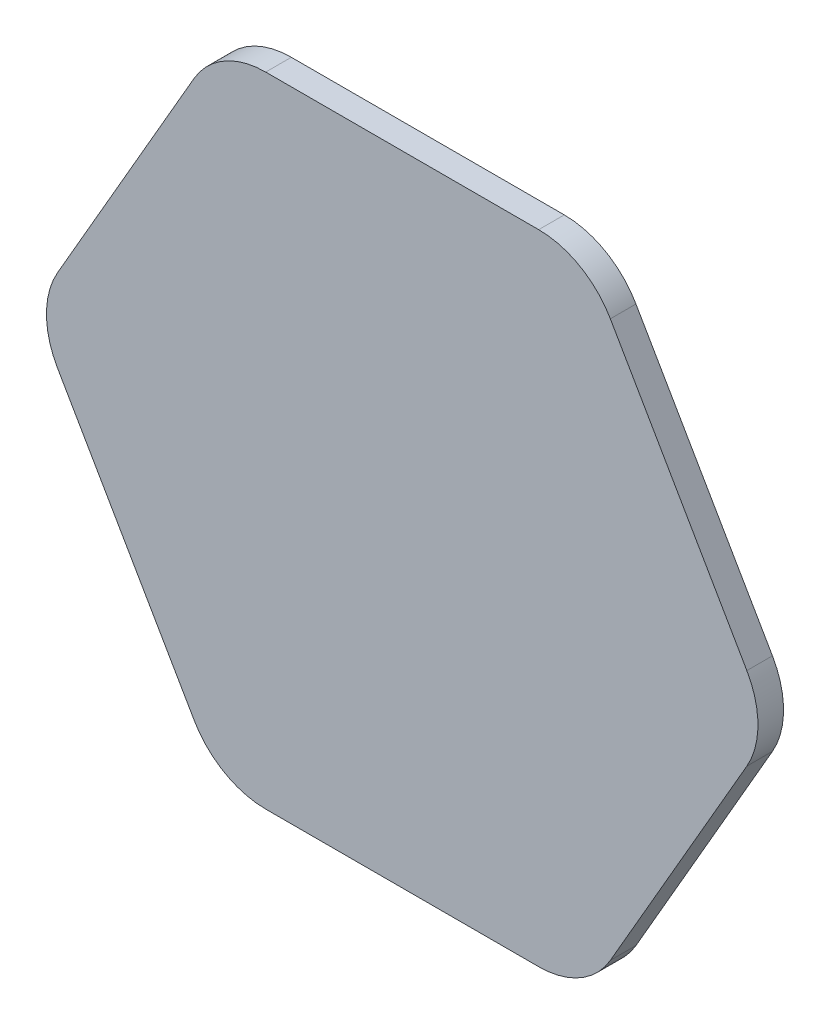
ISO-10303-21;
HEADER;
FILE_DESCRIPTION(('STEP AP214'),'2;1');
FILE_NAME('part.step','',(''),(''),'','','');
FILE_SCHEMA(('AUTOMOTIVE_DESIGN { 1 0 10303 214 1 1 1 1 }'));
ENDSEC;
DATA;
#1=APPLICATION_CONTEXT('core data for automotive mechanical design processes');
#2=APPLICATION_PROTOCOL_DEFINITION('international standard','automotive_design',2000,#1);
#3=PRODUCT_CONTEXT('',#1,'mechanical');
#4=PRODUCT('Part','Part','',(#3));
#5=PRODUCT_RELATED_PRODUCT_CATEGORY('part','',(#4));
#6=PRODUCT_DEFINITION_FORMATION('','',#4);
#7=PRODUCT_DEFINITION_CONTEXT('part definition',#1,'design');
#8=PRODUCT_DEFINITION('design','',#6,#7);
#9=PRODUCT_DEFINITION_SHAPE('','',#8);
#10=(LENGTH_UNIT() NAMED_UNIT(*) SI_UNIT(.MILLI.,.METRE.));
#11=(NAMED_UNIT(*) PLANE_ANGLE_UNIT() SI_UNIT($,.RADIAN.));
#12=(NAMED_UNIT(*) SI_UNIT($,.STERADIAN.) SOLID_ANGLE_UNIT());
#13=UNCERTAINTY_MEASURE_WITH_UNIT(LENGTH_MEASURE(1.E-05),#10,'distance_accuracy_value','');
#14=(GEOMETRIC_REPRESENTATION_CONTEXT(3) GLOBAL_UNCERTAINTY_ASSIGNED_CONTEXT((#13)) GLOBAL_UNIT_ASSIGNED_CONTEXT((#10,
#11,#12)) REPRESENTATION_CONTEXT('',''));
#15=CARTESIAN_POINT('',(0.,0.,0.));
#16=DIRECTION('',(0.,0.,1.));
#17=DIRECTION('',(1.,0.,0.));
#18=AXIS2_PLACEMENT_3D('',#15,#16,#17);
#19=CARTESIAN_POINT('',(25.4,43.9940905122495,4.7625));
#20=DIRECTION('',(0.,0.,-1.));
#21=DIRECTION('',(-1.,0.,0.));
#22=AXIS2_PLACEMENT_3D('',#19,#20,#21);
#23=CYLINDRICAL_SURFACE('',#22,15.3974594877505);
#24=CARTESIAN_POINT('',(25.4,43.9940905122495,0.));
#25=DIRECTION('',(0.,0.,1.));
#26=DIRECTION('',(1.,0.,0.));
#27=AXIS2_PLACEMENT_3D('',#24,#25,#26);
#28=CIRCLE('',#27,15.3974594877505);
#29=CARTESIAN_POINT('',(38.7345910701337,51.6928202561248,0.));
#30=VERTEX_POINT('',#29);
#31=CARTESIAN_POINT('',(25.4,59.39155,0.));
#32=VERTEX_POINT('',#31);
#33=EDGE_CURVE('E155',#30,#32,#28,.T.);
#34=ORIENTED_EDGE('',*,*,#33,.T.);
#35=DIRECTION('',(0.,0.,-1.));
#36=VECTOR('',#35,1.);
#37=CARTESIAN_POINT('',(25.4,59.39155,4.7625));
#38=LINE('',#37,#36);
#39=CARTESIAN_POINT('',(25.4,59.39155,4.7625));
#40=VERTEX_POINT('',#39);
#41=EDGE_CURVE('E11',#40,#32,#38,.T.);
#42=ORIENTED_EDGE('',*,*,#41,.F.);
#43=CARTESIAN_POINT('',(25.4,43.9940905122495,4.7625));
#44=DIRECTION('',(0.,0.,1.));
#45=DIRECTION('',(1.,0.,0.));
#46=AXIS2_PLACEMENT_3D('',#43,#44,#45);
#47=CIRCLE('',#46,15.3974594877505);
#48=CARTESIAN_POINT('',(38.7345910701337,51.6928202561248,4.7625));
#49=VERTEX_POINT('',#48);
#50=EDGE_CURVE('E177',#49,#40,#47,.T.);
#51=ORIENTED_EDGE('',*,*,#50,.F.);
#52=DIRECTION('',(0.,0.,-1.));
#53=VECTOR('',#52,1.);
#54=CARTESIAN_POINT('',(38.7345910701337,51.6928202561248,4.7625));
#55=LINE('',#54,#53);
#56=EDGE_CURVE('E151',#49,#30,#55,.T.);
#57=ORIENTED_EDGE('',*,*,#56,.T.);
#58=EDGE_LOOP('',(#34,#42,#51,#57));
#59=FACE_BOUND('',#58,.T.);
#60=ADVANCED_FACE('F35',(#59),#23,.T.);
#61=CARTESIAN_POINT('',(25.4,59.39155,4.7625));
#62=DIRECTION('',(0.,-1.,0.));
#63=DIRECTION('',(0.,0.,-1.));
#64=AXIS2_PLACEMENT_3D('',#61,#62,#63);
#65=PLANE('',#64);
#66=DIRECTION('',(-1.,0.,0.));
#67=VECTOR('',#66,1.);
#68=CARTESIAN_POINT('',(25.4,59.39155,0.));
#69=LINE('',#68,#67);
#70=CARTESIAN_POINT('',(-25.4,59.39155,0.));
#71=VERTEX_POINT('',#70);
#72=EDGE_CURVE('E158',#32,#71,#69,.T.);
#73=ORIENTED_EDGE('',*,*,#72,.T.);
#74=DIRECTION('',(0.,0.,-1.));
#75=VECTOR('',#74,1.);
#76=CARTESIAN_POINT('',(-25.4,59.39155,4.7625));
#77=LINE('',#76,#75);
#78=CARTESIAN_POINT('',(-25.4,59.39155,4.7625));
#79=VERTEX_POINT('',#78);
#80=EDGE_CURVE('E43',#79,#71,#77,.T.);
#81=ORIENTED_EDGE('',*,*,#80,.F.);
#82=DIRECTION('',(-1.,0.,0.));
#83=VECTOR('',#82,1.);
#84=CARTESIAN_POINT('',(25.4,59.39155,4.7625));
#85=LINE('',#84,#83);
#86=EDGE_CURVE('E106',#40,#79,#85,.T.);
#87=ORIENTED_EDGE('',*,*,#86,.F.);
#88=ORIENTED_EDGE('',*,*,#41,.T.);
#89=EDGE_LOOP('',(#73,#81,#87,#88));
#90=FACE_BOUND('',#89,.T.);
#91=ADVANCED_FACE('F255',(#90),#65,.F.);
#92=CARTESIAN_POINT('',(-25.4,43.9940905122495,4.7625));
#93=DIRECTION('',(0.,0.,-1.));
#94=DIRECTION('',(-1.,0.,0.));
#95=AXIS2_PLACEMENT_3D('',#92,#93,#94);
#96=CYLINDRICAL_SURFACE('',#95,15.3974594877505);
#97=CARTESIAN_POINT('',(-25.4,43.9940905122495,0.));
#98=DIRECTION('',(0.,0.,1.));
#99=DIRECTION('',(1.,0.,0.));
#100=AXIS2_PLACEMENT_3D('',#97,#98,#99);
#101=CIRCLE('',#100,15.3974594877505);
#102=CARTESIAN_POINT('',(-38.7345910701337,51.6928202561247,0.));
#103=VERTEX_POINT('',#102);
#104=EDGE_CURVE('E160',#71,#103,#101,.T.);
#105=ORIENTED_EDGE('',*,*,#104,.T.);
#106=DIRECTION('',(0.,0.,-1.));
#107=VECTOR('',#106,1.);
#108=CARTESIAN_POINT('',(-38.7345910701337,51.6928202561247,4.7625));
#109=LINE('',#108,#107);
#110=CARTESIAN_POINT('',(-38.7345910701337,51.6928202561247,4.7625));
#111=VERTEX_POINT('',#110);
#112=EDGE_CURVE('E196',#111,#103,#109,.T.);
#113=ORIENTED_EDGE('',*,*,#112,.F.);
#114=CARTESIAN_POINT('',(-25.4,43.9940905122495,4.7625));
#115=DIRECTION('',(0.,0.,1.));
#116=DIRECTION('',(1.,0.,0.));
#117=AXIS2_PLACEMENT_3D('',#114,#115,#116);
#118=CIRCLE('',#117,15.3974594877505);
#119=EDGE_CURVE('E204',#79,#111,#118,.T.);
#120=ORIENTED_EDGE('',*,*,#119,.F.);
#121=ORIENTED_EDGE('',*,*,#80,.T.);
#122=EDGE_LOOP('',(#105,#113,#120,#121));
#123=FACE_BOUND('',#122,.T.);
#124=ADVANCED_FACE('F202',(#123),#96,.T.);
#125=CARTESIAN_POINT('',(-38.7345910701337,51.6928202561247,4.7625));
#126=DIRECTION('',(0.866025403784439,-0.499999999999999,0.));
#127=DIRECTION('',(0.499999999999999,0.866025403784439,0.));
#128=AXIS2_PLACEMENT_3D('',#125,#126,#127);
#129=PLANE('',#128);
#130=DIRECTION('',(-0.499999999999999,-0.866025403784439,0.));
#131=VECTOR('',#130,1.);
#132=CARTESIAN_POINT('',(-38.7345910701337,51.6928202561247,0.));
#133=LINE('',#132,#131);
#134=CARTESIAN_POINT('',(-64.1345910701337,7.69872974387524,0.));
#135=VERTEX_POINT('',#134);
#136=EDGE_CURVE('E162',#103,#135,#133,.T.);
#137=ORIENTED_EDGE('',*,*,#136,.T.);
#138=DIRECTION('',(0.,0.,-1.));
#139=VECTOR('',#138,1.);
#140=CARTESIAN_POINT('',(-64.1345910701337,7.69872974387524,4.7625));
#141=LINE('',#140,#139);
#142=CARTESIAN_POINT('',(-64.1345910701337,7.69872974387524,4.7625));
#143=VERTEX_POINT('',#142);
#144=EDGE_CURVE('E193',#143,#135,#141,.T.);
#145=ORIENTED_EDGE('',*,*,#144,.F.);
#146=DIRECTION('',(-0.499999999999999,-0.866025403784439,0.));
#147=VECTOR('',#146,1.);
#148=CARTESIAN_POINT('',(-38.7345910701337,51.6928202561247,4.7625));
#149=LINE('',#148,#147);
#150=EDGE_CURVE('E222',#111,#143,#149,.T.);
#151=ORIENTED_EDGE('',*,*,#150,.F.);
#152=ORIENTED_EDGE('',*,*,#112,.T.);
#153=EDGE_LOOP('',(#137,#145,#151,#152));
#154=FACE_BOUND('',#153,.T.);
#155=ADVANCED_FACE('F213',(#154),#129,.F.);
#156=CARTESIAN_POINT('',(-50.8,0.,4.7625));
#157=DIRECTION('',(0.,0.,-1.));
#158=DIRECTION('',(-1.,0.,0.));
#159=AXIS2_PLACEMENT_3D('',#156,#157,#158);
#160=CYLINDRICAL_SURFACE('',#159,15.3974594877505);
#161=CARTESIAN_POINT('',(-50.8,0.,0.));
#162=DIRECTION('',(0.,0.,1.));
#163=DIRECTION('',(1.,0.,0.));
#164=AXIS2_PLACEMENT_3D('',#161,#162,#163);
#165=CIRCLE('',#164,15.3974594877505);
#166=CARTESIAN_POINT('',(-64.1345910701337,-7.69872974387528,0.));
#167=VERTEX_POINT('',#166);
#168=EDGE_CURVE('E164',#135,#167,#165,.T.);
#169=ORIENTED_EDGE('',*,*,#168,.T.);
#170=DIRECTION('',(0.,0.,-1.));
#171=VECTOR('',#170,1.);
#172=CARTESIAN_POINT('',(-64.1345910701337,-7.69872974387528,4.7625));
#173=LINE('',#172,#171);
#174=CARTESIAN_POINT('',(-64.1345910701337,-7.69872974387528,4.7625));
#175=VERTEX_POINT('',#174);
#176=EDGE_CURVE('E190',#175,#167,#173,.T.);
#177=ORIENTED_EDGE('',*,*,#176,.F.);
#178=CARTESIAN_POINT('',(-50.8,0.,4.7625));
#179=DIRECTION('',(0.,0.,1.));
#180=DIRECTION('',(1.,0.,0.));
#181=AXIS2_PLACEMENT_3D('',#178,#179,#180);
#182=CIRCLE('',#181,15.3974594877505);
#183=EDGE_CURVE('E219',#143,#175,#182,.T.);
#184=ORIENTED_EDGE('',*,*,#183,.F.);
#185=ORIENTED_EDGE('',*,*,#144,.T.);
#186=EDGE_LOOP('',(#169,#177,#184,#185));
#187=FACE_BOUND('',#186,.T.);
#188=ADVANCED_FACE('F217',(#187),#160,.T.);
#189=CARTESIAN_POINT('',(-64.1345910701337,-7.69872974387528,4.7625));
#190=DIRECTION('',(0.866025403784439,0.5,0.));
#191=DIRECTION('',(-0.5,0.866025403784439,0.));
#192=AXIS2_PLACEMENT_3D('',#189,#190,#191);
#193=PLANE('',#192);
#194=DIRECTION('',(0.5,-0.866025403784439,0.));
#195=VECTOR('',#194,1.);
#196=CARTESIAN_POINT('',(-64.1345910701337,-7.69872974387528,0.));
#197=LINE('',#196,#195);
#198=CARTESIAN_POINT('',(-38.7345910701337,-51.6928202561247,0.));
#199=VERTEX_POINT('',#198);
#200=EDGE_CURVE('E166',#167,#199,#197,.T.);
#201=ORIENTED_EDGE('',*,*,#200,.T.);
#202=DIRECTION('',(0.,0.,-1.));
#203=VECTOR('',#202,1.);
#204=CARTESIAN_POINT('',(-38.7345910701337,-51.6928202561247,4.7625));
#205=LINE('',#204,#203);
#206=CARTESIAN_POINT('',(-38.7345910701337,-51.6928202561247,4.7625));
#207=VERTEX_POINT('',#206);
#208=EDGE_CURVE('E187',#207,#199,#205,.T.);
#209=ORIENTED_EDGE('',*,*,#208,.F.);
#210=DIRECTION('',(0.5,-0.866025403784439,0.));
#211=VECTOR('',#210,1.);
#212=CARTESIAN_POINT('',(-64.1345910701337,-7.69872974387528,4.7625));
#213=LINE('',#212,#211);
#214=EDGE_CURVE('E221',#175,#207,#213,.T.);
#215=ORIENTED_EDGE('',*,*,#214,.F.);
#216=ORIENTED_EDGE('',*,*,#176,.T.);
#217=EDGE_LOOP('',(#201,#209,#215,#216));
#218=FACE_BOUND('',#217,.T.);
#219=ADVANCED_FACE('F268',(#218),#193,.F.);
#220=CARTESIAN_POINT('',(-25.4,-43.9940905122495,4.7625));
#221=DIRECTION('',(0.,0.,-1.));
#222=DIRECTION('',(-1.,0.,0.));
#223=AXIS2_PLACEMENT_3D('',#220,#221,#222);
#224=CYLINDRICAL_SURFACE('',#223,15.3974594877505);
#225=CARTESIAN_POINT('',(-25.4,-43.9940905122495,0.));
#226=DIRECTION('',(0.,0.,1.));
#227=DIRECTION('',(1.,0.,0.));
#228=AXIS2_PLACEMENT_3D('',#225,#226,#227);
#229=CIRCLE('',#228,15.3974594877505);
#230=CARTESIAN_POINT('',(-25.4,-59.39155,0.));
#231=VERTEX_POINT('',#230);
#232=EDGE_CURVE('E168',#199,#231,#229,.T.);
#233=ORIENTED_EDGE('',*,*,#232,.T.);
#234=DIRECTION('',(0.,0.,-1.));
#235=VECTOR('',#234,1.);
#236=CARTESIAN_POINT('',(-25.4,-59.39155,4.7625));
#237=LINE('',#236,#235);
#238=CARTESIAN_POINT('',(-25.4,-59.39155,4.7625));
#239=VERTEX_POINT('',#238);
#240=EDGE_CURVE('E184',#239,#231,#237,.T.);
#241=ORIENTED_EDGE('',*,*,#240,.F.);
#242=CARTESIAN_POINT('',(-25.4,-43.9940905122495,4.7625));
#243=DIRECTION('',(0.,0.,1.));
#244=DIRECTION('',(1.,0.,0.));
#245=AXIS2_PLACEMENT_3D('',#242,#243,#244);
#246=CIRCLE('',#245,15.3974594877505);
#247=EDGE_CURVE('E224',#207,#239,#246,.T.);
#248=ORIENTED_EDGE('',*,*,#247,.F.);
#249=ORIENTED_EDGE('',*,*,#208,.T.);
#250=EDGE_LOOP('',(#233,#241,#248,#249));
#251=FACE_BOUND('',#250,.T.);
#252=ADVANCED_FACE('F271',(#251),#224,.T.);
#253=CARTESIAN_POINT('',(-25.4,-59.39155,4.7625));
#254=DIRECTION('',(0.,1.,0.));
#255=DIRECTION('',(0.,0.,1.));
#256=AXIS2_PLACEMENT_3D('',#253,#254,#255);
#257=PLANE('',#256);
#258=DIRECTION('',(1.,0.,0.));
#259=VECTOR('',#258,1.);
#260=CARTESIAN_POINT('',(-25.4,-59.39155,0.));
#261=LINE('',#260,#259);
#262=CARTESIAN_POINT('',(25.4,-59.39155,0.));
#263=VERTEX_POINT('',#262);
#264=EDGE_CURVE('E170',#231,#263,#261,.T.);
#265=ORIENTED_EDGE('',*,*,#264,.T.);
#266=DIRECTION('',(0.,0.,-1.));
#267=VECTOR('',#266,1.);
#268=CARTESIAN_POINT('',(25.4,-59.39155,4.7625));
#269=LINE('',#268,#267);
#270=CARTESIAN_POINT('',(25.4,-59.39155,4.7625));
#271=VERTEX_POINT('',#270);
#272=EDGE_CURVE('E181',#271,#263,#269,.T.);
#273=ORIENTED_EDGE('',*,*,#272,.F.);
#274=DIRECTION('',(1.,0.,0.));
#275=VECTOR('',#274,1.);
#276=CARTESIAN_POINT('',(-25.4,-59.39155,4.7625));
#277=LINE('',#276,#275);
#278=EDGE_CURVE('E230',#239,#271,#277,.T.);
#279=ORIENTED_EDGE('',*,*,#278,.F.);
#280=ORIENTED_EDGE('',*,*,#240,.T.);
#281=EDGE_LOOP('',(#265,#273,#279,#280));
#282=FACE_BOUND('',#281,.T.);
#283=ADVANCED_FACE('F236',(#282),#257,.F.);
#284=CARTESIAN_POINT('',(25.4,-43.9940905122495,4.7625));
#285=DIRECTION('',(0.,0.,-1.));
#286=DIRECTION('',(-1.,0.,0.));
#287=AXIS2_PLACEMENT_3D('',#284,#285,#286);
#288=CYLINDRICAL_SURFACE('',#287,15.3974594877505);
#289=CARTESIAN_POINT('',(25.4,-43.9940905122495,0.));
#290=DIRECTION('',(0.,0.,1.));
#291=DIRECTION('',(1.,0.,0.));
#292=AXIS2_PLACEMENT_3D('',#289,#290,#291);
#293=CIRCLE('',#292,15.3974594877505);
#294=CARTESIAN_POINT('',(38.7345910701337,-51.6928202561247,0.));
#295=VERTEX_POINT('',#294);
#296=EDGE_CURVE('E172',#263,#295,#293,.T.);
#297=ORIENTED_EDGE('',*,*,#296,.T.);
#298=DIRECTION('',(0.,0.,-1.));
#299=VECTOR('',#298,1.);
#300=CARTESIAN_POINT('',(38.7345910701337,-51.6928202561247,4.7625));
#301=LINE('',#300,#299);
#302=CARTESIAN_POINT('',(38.7345910701337,-51.6928202561247,4.7625));
#303=VERTEX_POINT('',#302);
#304=EDGE_CURVE('E146',#303,#295,#301,.T.);
#305=ORIENTED_EDGE('',*,*,#304,.F.);
#306=CARTESIAN_POINT('',(25.4,-43.9940905122495,4.7625));
#307=DIRECTION('',(0.,0.,1.));
#308=DIRECTION('',(1.,0.,0.));
#309=AXIS2_PLACEMENT_3D('',#306,#307,#308);
#310=CIRCLE('',#309,15.3974594877505);
#311=EDGE_CURVE('E137',#271,#303,#310,.T.);
#312=ORIENTED_EDGE('',*,*,#311,.F.);
#313=ORIENTED_EDGE('',*,*,#272,.T.);
#314=EDGE_LOOP('',(#297,#305,#312,#313));
#315=FACE_BOUND('',#314,.T.);
#316=ADVANCED_FACE('F240',(#315),#288,.T.);
#317=CARTESIAN_POINT('',(38.7345910701337,-51.6928202561247,4.7625));
#318=DIRECTION('',(-0.866025403784439,0.5,0.));
#319=DIRECTION('',(-0.5,-0.866025403784439,0.));
#320=AXIS2_PLACEMENT_3D('',#317,#318,#319);
#321=PLANE('',#320);
#322=DIRECTION('',(0.5,0.866025403784439,0.));
#323=VECTOR('',#322,1.);
#324=CARTESIAN_POINT('',(38.7345910701337,-51.6928202561247,0.));
#325=LINE('',#324,#323);
#326=CARTESIAN_POINT('',(64.1345910701337,-7.69872974387523,0.));
#327=VERTEX_POINT('',#326);
#328=EDGE_CURVE('E145',#295,#327,#325,.T.);
#329=ORIENTED_EDGE('',*,*,#328,.T.);
#330=DIRECTION('',(0.,0.,-1.));
#331=VECTOR('',#330,1.);
#332=CARTESIAN_POINT('',(64.1345910701337,-7.69872974387523,4.7625));
#333=LINE('',#332,#331);
#334=CARTESIAN_POINT('',(64.1345910701337,-7.69872974387523,4.7625));
#335=VERTEX_POINT('',#334);
#336=EDGE_CURVE('E142',#335,#327,#333,.T.);
#337=ORIENTED_EDGE('',*,*,#336,.F.);
#338=DIRECTION('',(0.5,0.866025403784439,0.));
#339=VECTOR('',#338,1.);
#340=CARTESIAN_POINT('',(38.7345910701337,-51.6928202561247,4.7625));
#341=LINE('',#340,#339);
#342=EDGE_CURVE('E131',#303,#335,#341,.T.);
#343=ORIENTED_EDGE('',*,*,#342,.F.);
#344=ORIENTED_EDGE('',*,*,#304,.T.);
#345=EDGE_LOOP('',(#329,#337,#343,#344));
#346=FACE_BOUND('',#345,.T.);
#347=ADVANCED_FACE('F143',(#346),#321,.F.);
#348=CARTESIAN_POINT('',(50.8,0.,4.7625));
#349=DIRECTION('',(0.,0.,-1.));
#350=DIRECTION('',(-1.,0.,0.));
#351=AXIS2_PLACEMENT_3D('',#348,#349,#350);
#352=CYLINDRICAL_SURFACE('',#351,15.3974594877505);
#353=CARTESIAN_POINT('',(50.8,0.,0.));
#354=DIRECTION('',(0.,0.,1.));
#355=DIRECTION('',(-1.,0.,0.));
#356=AXIS2_PLACEMENT_3D('',#353,#354,#355);
#357=CIRCLE('',#356,15.3974594877505);
#358=CARTESIAN_POINT('',(64.1345910701337,7.69872974387529,0.));
#359=VERTEX_POINT('',#358);
#360=EDGE_CURVE('E92',#327,#359,#357,.T.);
#361=ORIENTED_EDGE('',*,*,#360,.T.);
#362=DIRECTION('',(0.,0.,-1.));
#363=VECTOR('',#362,1.);
#364=CARTESIAN_POINT('',(64.1345910701337,7.69872974387529,4.7625));
#365=LINE('',#364,#363);
#366=CARTESIAN_POINT('',(64.1345910701337,7.69872974387529,4.7625));
#367=VERTEX_POINT('',#366);
#368=EDGE_CURVE('E147',#367,#359,#365,.T.);
#369=ORIENTED_EDGE('',*,*,#368,.F.);
#370=CARTESIAN_POINT('',(50.8,0.,4.7625));
#371=DIRECTION('',(0.,0.,1.));
#372=DIRECTION('',(-1.,0.,0.));
#373=AXIS2_PLACEMENT_3D('',#370,#371,#372);
#374=CIRCLE('',#373,15.3974594877505);
#375=EDGE_CURVE('E135',#335,#367,#374,.T.);
#376=ORIENTED_EDGE('',*,*,#375,.F.);
#377=ORIENTED_EDGE('',*,*,#336,.T.);
#378=EDGE_LOOP('',(#361,#369,#376,#377));
#379=FACE_BOUND('',#378,.T.);
#380=ADVANCED_FACE('F149',(#379),#352,.T.);
#381=CARTESIAN_POINT('',(64.1345910701337,7.69872974387529,4.7625));
#382=DIRECTION('',(-0.866025403784439,-0.5,0.));
#383=DIRECTION('',(0.5,-0.866025403784439,0.));
#384=AXIS2_PLACEMENT_3D('',#381,#382,#383);
#385=PLANE('',#384);
#386=DIRECTION('',(-0.5,0.866025403784439,0.));
#387=VECTOR('',#386,1.);
#388=CARTESIAN_POINT('',(64.1345910701337,7.69872974387529,0.));
#389=LINE('',#388,#387);
#390=EDGE_CURVE('E98',#359,#30,#389,.T.);
#391=ORIENTED_EDGE('',*,*,#390,.T.);
#392=ORIENTED_EDGE('',*,*,#56,.F.);
#393=DIRECTION('',(-0.5,0.866025403784439,0.));
#394=VECTOR('',#393,1.);
#395=CARTESIAN_POINT('',(64.1345910701337,7.69872974387529,4.7625));
#396=LINE('',#395,#394);
#397=EDGE_CURVE('E51',#367,#49,#396,.T.);
#398=ORIENTED_EDGE('',*,*,#397,.F.);
#399=ORIENTED_EDGE('',*,*,#368,.T.);
#400=EDGE_LOOP('',(#391,#392,#398,#399));
#401=FACE_BOUND('',#400,.T.);
#402=ADVANCED_FACE('F244',(#401),#385,.F.);
#403=CARTESIAN_POINT('',(25.4,43.9940905122495,4.7625));
#404=DIRECTION('',(0.,0.,1.));
#405=DIRECTION('',(1.,0.,0.));
#406=AXIS2_PLACEMENT_3D('',#403,#404,#405);
#407=PLANE('',#406);
#408=ORIENTED_EDGE('',*,*,#50,.T.);
#409=ORIENTED_EDGE('',*,*,#86,.T.);
#410=ORIENTED_EDGE('',*,*,#119,.T.);
#411=ORIENTED_EDGE('',*,*,#150,.T.);
#412=ORIENTED_EDGE('',*,*,#183,.T.);
#413=ORIENTED_EDGE('',*,*,#214,.T.);
#414=ORIENTED_EDGE('',*,*,#247,.T.);
#415=ORIENTED_EDGE('',*,*,#278,.T.);
#416=ORIENTED_EDGE('',*,*,#311,.T.);
#417=ORIENTED_EDGE('',*,*,#342,.T.);
#418=ORIENTED_EDGE('',*,*,#375,.T.);
#419=ORIENTED_EDGE('',*,*,#397,.T.);
#420=EDGE_LOOP('',(#408,#409,#410,#411,#412,#413,#414,#415,#416,#417,#418,#419));
#421=FACE_BOUND('',#420,.T.);
#422=ADVANCED_FACE('F133',(#421),#407,.T.);
#423=CARTESIAN_POINT('',(25.4,43.9940905122495,0.));
#424=DIRECTION('',(0.,0.,1.));
#425=DIRECTION('',(1.,0.,0.));
#426=AXIS2_PLACEMENT_3D('',#423,#424,#425);
#427=PLANE('',#426);
#428=ORIENTED_EDGE('',*,*,#33,.F.);
#429=ORIENTED_EDGE('',*,*,#390,.F.);
#430=ORIENTED_EDGE('',*,*,#360,.F.);
#431=ORIENTED_EDGE('',*,*,#328,.F.);
#432=ORIENTED_EDGE('',*,*,#296,.F.);
#433=ORIENTED_EDGE('',*,*,#264,.F.);
#434=ORIENTED_EDGE('',*,*,#232,.F.);
#435=ORIENTED_EDGE('',*,*,#200,.F.);
#436=ORIENTED_EDGE('',*,*,#168,.F.);
#437=ORIENTED_EDGE('',*,*,#136,.F.);
#438=ORIENTED_EDGE('',*,*,#104,.F.);
#439=ORIENTED_EDGE('',*,*,#72,.F.);
#440=EDGE_LOOP('',(#428,#429,#430,#431,#432,#433,#434,#435,#436,#437,#438,#439));
#441=FACE_BOUND('',#440,.T.);
#442=ADVANCED_FACE('F208',(#441),#427,.F.);
#443=CLOSED_SHELL('',(#60,#91,#124,#155,#188,#219,#252,#283,#316,#347,#380,#402,#422,#442));
#444=MANIFOLD_SOLID_BREP('B2',#443);
#445=ADVANCED_BREP_SHAPE_REPRESENTATION('',(#18,#444),#14);
#446=SHAPE_DEFINITION_REPRESENTATION(#9,#445);
ENDSEC;
END-ISO-10303-21;
